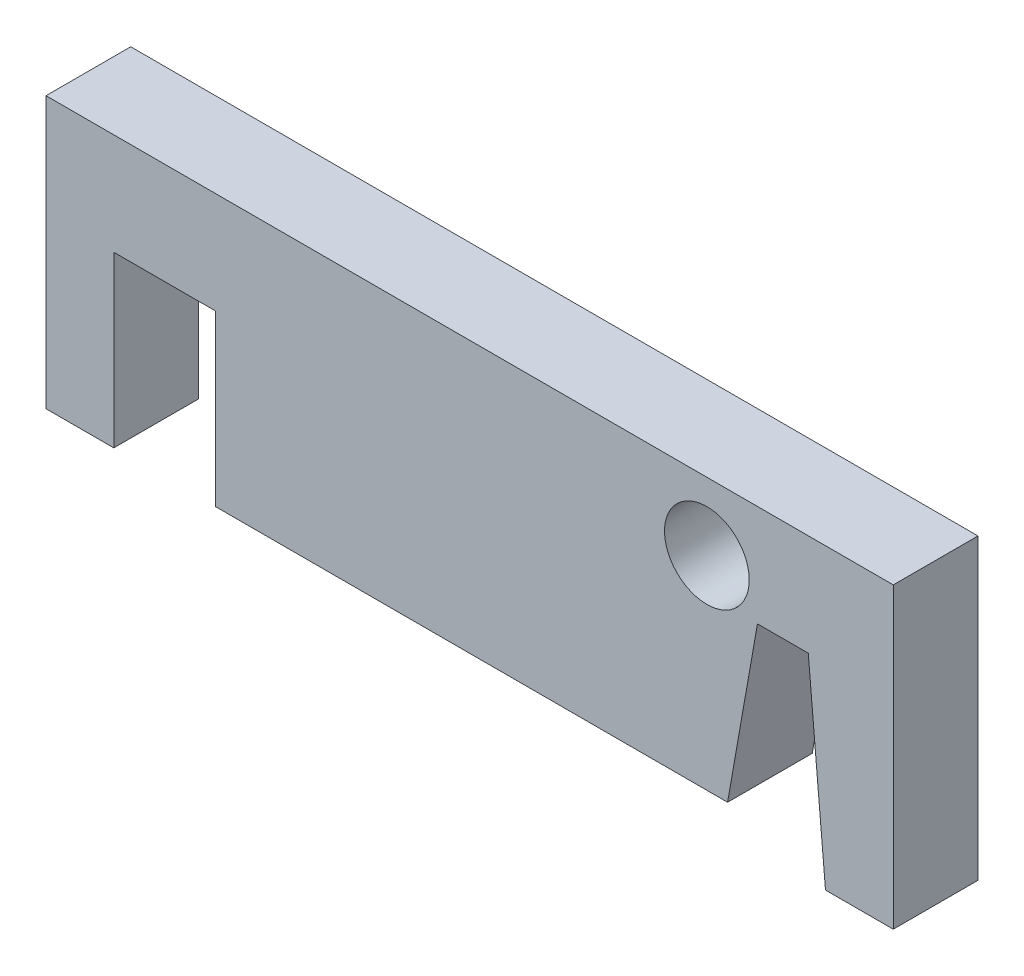
ISO-10303-21;
HEADER;
FILE_DESCRIPTION(('STEP AP214'),'2;1');
FILE_NAME('part.step','',(''),(''),'','','');
FILE_SCHEMA(('AUTOMOTIVE_DESIGN { 1 0 10303 214 1 1 1 1 }'));
ENDSEC;
DATA;
#1=APPLICATION_CONTEXT('core data for automotive mechanical design processes');
#2=APPLICATION_PROTOCOL_DEFINITION('international standard','automotive_design',2000,#1);
#3=PRODUCT_CONTEXT('',#1,'mechanical');
#4=PRODUCT('Part','Part','',(#3));
#5=PRODUCT_RELATED_PRODUCT_CATEGORY('part','',(#4));
#6=PRODUCT_DEFINITION_FORMATION('','',#4);
#7=PRODUCT_DEFINITION_CONTEXT('part definition',#1,'design');
#8=PRODUCT_DEFINITION('design','',#6,#7);
#9=PRODUCT_DEFINITION_SHAPE('','',#8);
#10=(LENGTH_UNIT() NAMED_UNIT(*) SI_UNIT(.MILLI.,.METRE.));
#11=(NAMED_UNIT(*) PLANE_ANGLE_UNIT() SI_UNIT($,.RADIAN.));
#12=(NAMED_UNIT(*) SI_UNIT($,.STERADIAN.) SOLID_ANGLE_UNIT());
#13=UNCERTAINTY_MEASURE_WITH_UNIT(LENGTH_MEASURE(1.E-05),#10,'distance_accuracy_value','');
#14=(GEOMETRIC_REPRESENTATION_CONTEXT(3) GLOBAL_UNCERTAINTY_ASSIGNED_CONTEXT((#13)) GLOBAL_UNIT_ASSIGNED_CONTEXT((#10,
#11,#12)) REPRESENTATION_CONTEXT('',''));
#15=CARTESIAN_POINT('',(0.,0.,0.));
#16=DIRECTION('',(0.,0.,1.));
#17=DIRECTION('',(1.,0.,0.));
#18=AXIS2_PLACEMENT_3D('',#15,#16,#17);
#19=CARTESIAN_POINT('',(0.,-13.97,3.175));
#20=DIRECTION('',(0.,-1.,0.));
#21=DIRECTION('',(1.,0.,0.));
#22=AXIS2_PLACEMENT_3D('',#19,#20,#21);
#23=PLANE('',#22);
#24=DIRECTION('',(0.,0.,1.));
#25=VECTOR('',#24,1.);
#26=CARTESIAN_POINT('',(-19.05,-13.97,-3.175));
#27=LINE('',#26,#25);
#28=CARTESIAN_POINT('',(-19.05,-13.97,-3.175));
#29=VERTEX_POINT('',#28);
#30=CARTESIAN_POINT('',(-19.05,-13.97,3.175));
#31=VERTEX_POINT('',#30);
#32=EDGE_CURVE('E169',#29,#31,#27,.T.);
#33=ORIENTED_EDGE('',*,*,#32,.F.);
#34=DIRECTION('',(-1.,0.,0.));
#35=VECTOR('',#34,1.);
#36=CARTESIAN_POINT('',(0.,-13.97,-3.175));
#37=LINE('',#36,#35);
#38=CARTESIAN_POINT('',(19.3317643539386,-13.97,-3.175));
#39=VERTEX_POINT('',#38);
#40=EDGE_CURVE('E194',#39,#29,#37,.T.);
#41=ORIENTED_EDGE('',*,*,#40,.F.);
#42=DIRECTION('',(0.,0.,-1.));
#43=VECTOR('',#42,1.);
#44=CARTESIAN_POINT('',(19.3317643539386,-13.97,3.175));
#45=LINE('',#44,#43);
#46=CARTESIAN_POINT('',(19.3317643539386,-13.97,3.175));
#47=VERTEX_POINT('',#46);
#48=EDGE_CURVE('E72',#47,#39,#45,.T.);
#49=ORIENTED_EDGE('',*,*,#48,.F.);
#50=DIRECTION('',(-1.,0.,0.));
#51=VECTOR('',#50,1.);
#52=CARTESIAN_POINT('',(0.,-13.97,3.175));
#53=LINE('',#52,#51);
#54=EDGE_CURVE('E159',#47,#31,#53,.T.);
#55=ORIENTED_EDGE('',*,*,#54,.T.);
#56=EDGE_LOOP('',(#33,#41,#49,#55));
#57=FACE_BOUND('',#56,.T.);
#58=ADVANCED_FACE('F47',(#57),#23,.T.);
#59=CARTESIAN_POINT('',(21.1378510331832,-3.72717345134659,3.175));
#60=DIRECTION('',(0.984807753012207,-0.173648177666934,0.));
#61=DIRECTION('',(0.173648177666934,0.984807753012207,0.));
#62=AXIS2_PLACEMENT_3D('',#59,#60,#61);
#63=PLANE('',#62);
#64=DIRECTION('',(-0.173648177666934,-0.984807753012208,0.));
#65=VECTOR('',#64,1.);
#66=CARTESIAN_POINT('',(21.1378510331832,-3.72717345134659,-3.175));
#67=LINE('',#66,#65);
#68=CARTESIAN_POINT('',(21.5711170089362,-1.27,-3.175));
#69=VERTEX_POINT('',#68);
#70=EDGE_CURVE('E168',#69,#39,#67,.T.);
#71=ORIENTED_EDGE('',*,*,#70,.F.);
#72=DIRECTION('',(0.,0.,-1.));
#73=VECTOR('',#72,1.);
#74=CARTESIAN_POINT('',(21.5711170089362,-1.27,3.175));
#75=LINE('',#74,#73);
#76=CARTESIAN_POINT('',(21.5711170089362,-1.27,3.175));
#77=VERTEX_POINT('',#76);
#78=EDGE_CURVE('E11',#77,#69,#75,.T.);
#79=ORIENTED_EDGE('',*,*,#78,.F.);
#80=DIRECTION('',(-0.173648177666934,-0.984807753012208,0.));
#81=VECTOR('',#80,1.);
#82=CARTESIAN_POINT('',(21.1378510331832,-3.72717345134659,3.175));
#83=LINE('',#82,#81);
#84=EDGE_CURVE('E259',#77,#47,#83,.T.);
#85=ORIENTED_EDGE('',*,*,#84,.T.);
#86=ORIENTED_EDGE('',*,*,#48,.T.);
#87=EDGE_LOOP('',(#71,#79,#85,#86));
#88=FACE_BOUND('',#87,.T.);
#89=ADVANCED_FACE('F229',(#88),#63,.T.);
#90=CARTESIAN_POINT('',(0.,-1.27000000000001,3.175));
#91=DIRECTION('',(0.,-1.,0.));
#92=DIRECTION('',(1.,0.,0.));
#93=AXIS2_PLACEMENT_3D('',#90,#91,#92);
#94=PLANE('',#93);
#95=DIRECTION('',(-1.,0.,0.));
#96=VECTOR('',#95,1.);
#97=CARTESIAN_POINT('',(0.,-1.27000000000001,-3.175));
#98=LINE('',#97,#96);
#99=CARTESIAN_POINT('',(25.3811170089362,-1.27,-3.175));
#100=VERTEX_POINT('',#99);
#101=EDGE_CURVE('E172',#100,#69,#98,.T.);
#102=ORIENTED_EDGE('',*,*,#101,.F.);
#103=DIRECTION('',(0.,0.,-1.));
#104=VECTOR('',#103,1.);
#105=CARTESIAN_POINT('',(25.3811170089362,-1.27,3.175));
#106=LINE('',#105,#104);
#107=CARTESIAN_POINT('',(25.3811170089362,-1.27,3.175));
#108=VERTEX_POINT('',#107);
#109=EDGE_CURVE('E56',#108,#100,#106,.T.);
#110=ORIENTED_EDGE('',*,*,#109,.F.);
#111=DIRECTION('',(-1.,0.,0.));
#112=VECTOR('',#111,1.);
#113=CARTESIAN_POINT('',(0.,-1.27000000000001,3.175));
#114=LINE('',#113,#112);
#115=EDGE_CURVE('E228',#108,#77,#114,.T.);
#116=ORIENTED_EDGE('',*,*,#115,.T.);
#117=ORIENTED_EDGE('',*,*,#78,.T.);
#118=EDGE_LOOP('',(#102,#110,#116,#117));
#119=FACE_BOUND('',#118,.T.);
#120=ADVANCED_FACE('F227',(#119),#94,.T.);
#121=CARTESIAN_POINT('',(25.0780523169048,2.19404528103904,3.175));
#122=DIRECTION('',(0.996194698091746,0.0871557427476517,0.));
#123=DIRECTION('',(-0.0871557427476517,0.996194698091746,0.));
#124=AXIS2_PLACEMENT_3D('',#121,#122,#123);
#125=PLANE('',#124);
#126=DIRECTION('',(0.0871557427476517,-0.996194698091746,0.));
#127=VECTOR('',#126,1.);
#128=CARTESIAN_POINT('',(25.0780523169048,2.19404528103904,-3.175));
#129=LINE('',#128,#127);
#130=CARTESIAN_POINT('',(26.67,-16.002,-3.175));
#131=VERTEX_POINT('',#130);
#132=EDGE_CURVE('E176',#100,#131,#129,.T.);
#133=ORIENTED_EDGE('',*,*,#132,.T.);
#134=DIRECTION('',(0.,0.,-1.));
#135=VECTOR('',#134,1.);
#136=CARTESIAN_POINT('',(26.67,-16.002,3.175));
#137=LINE('',#136,#135);
#138=CARTESIAN_POINT('',(26.67,-16.002,3.175));
#139=VERTEX_POINT('',#138);
#140=EDGE_CURVE('E209',#139,#131,#137,.T.);
#141=ORIENTED_EDGE('',*,*,#140,.F.);
#142=DIRECTION('',(0.0871557427476517,-0.996194698091746,0.));
#143=VECTOR('',#142,1.);
#144=CARTESIAN_POINT('',(25.0780523169048,2.19404528103904,3.175));
#145=LINE('',#144,#143);
#146=EDGE_CURVE('E219',#108,#139,#145,.T.);
#147=ORIENTED_EDGE('',*,*,#146,.F.);
#148=ORIENTED_EDGE('',*,*,#109,.T.);
#149=EDGE_LOOP('',(#133,#141,#147,#148));
#150=FACE_BOUND('',#149,.T.);
#151=ADVANCED_FACE('F216',(#150),#125,.F.);
#152=CARTESIAN_POINT('',(0.,-16.002,3.175));
#153=DIRECTION('',(0.,1.,0.));
#154=DIRECTION('',(0.,0.,1.));
#155=AXIS2_PLACEMENT_3D('',#152,#153,#154);
#156=PLANE('',#155);
#157=DIRECTION('',(1.,0.,0.));
#158=VECTOR('',#157,1.);
#159=CARTESIAN_POINT('',(0.,-16.002,-3.175));
#160=LINE('',#159,#158);
#161=CARTESIAN_POINT('',(31.75,-16.002,-3.175));
#162=VERTEX_POINT('',#161);
#163=EDGE_CURVE('E180',#131,#162,#160,.T.);
#164=ORIENTED_EDGE('',*,*,#163,.T.);
#165=DIRECTION('',(0.,0.,-1.));
#166=VECTOR('',#165,1.);
#167=CARTESIAN_POINT('',(31.75,-16.002,3.175));
#168=LINE('',#167,#166);
#169=CARTESIAN_POINT('',(31.75,-16.002,3.175));
#170=VERTEX_POINT('',#169);
#171=EDGE_CURVE('E205',#170,#162,#168,.T.);
#172=ORIENTED_EDGE('',*,*,#171,.F.);
#173=DIRECTION('',(1.,0.,0.));
#174=VECTOR('',#173,1.);
#175=CARTESIAN_POINT('',(0.,-16.002,3.175));
#176=LINE('',#175,#174);
#177=EDGE_CURVE('E266',#139,#170,#176,.T.);
#178=ORIENTED_EDGE('',*,*,#177,.F.);
#179=ORIENTED_EDGE('',*,*,#140,.T.);
#180=EDGE_LOOP('',(#164,#172,#178,#179));
#181=FACE_BOUND('',#180,.T.);
#182=ADVANCED_FACE('F307',(#181),#156,.F.);
#183=CARTESIAN_POINT('',(31.75,0.,3.175));
#184=DIRECTION('',(-1.,0.,0.));
#185=DIRECTION('',(0.,0.,1.));
#186=AXIS2_PLACEMENT_3D('',#183,#184,#185);
#187=PLANE('',#186);
#188=DIRECTION('',(0.,1.,0.));
#189=VECTOR('',#188,1.);
#190=CARTESIAN_POINT('',(31.75,0.,-3.175));
#191=LINE('',#190,#189);
#192=CARTESIAN_POINT('',(31.75,6.35,-3.175));
#193=VERTEX_POINT('',#192);
#194=EDGE_CURVE('E184',#162,#193,#191,.T.);
#195=ORIENTED_EDGE('',*,*,#194,.T.);
#196=DIRECTION('',(0.,0.,-1.));
#197=VECTOR('',#196,1.);
#198=CARTESIAN_POINT('',(31.75,6.35,3.175));
#199=LINE('',#198,#197);
#200=CARTESIAN_POINT('',(31.75,6.35,3.175));
#201=VERTEX_POINT('',#200);
#202=EDGE_CURVE('E137',#201,#193,#199,.T.);
#203=ORIENTED_EDGE('',*,*,#202,.F.);
#204=DIRECTION('',(0.,1.,0.));
#205=VECTOR('',#204,1.);
#206=CARTESIAN_POINT('',(31.75,0.,3.175));
#207=LINE('',#206,#205);
#208=EDGE_CURVE('E148',#170,#201,#207,.T.);
#209=ORIENTED_EDGE('',*,*,#208,.F.);
#210=ORIENTED_EDGE('',*,*,#171,.T.);
#211=EDGE_LOOP('',(#195,#203,#209,#210));
#212=FACE_BOUND('',#211,.T.);
#213=ADVANCED_FACE('F309',(#212),#187,.F.);
#214=CARTESIAN_POINT('',(0.,6.35,3.175));
#215=DIRECTION('',(0.,1.,0.));
#216=DIRECTION('',(0.,0.,1.));
#217=AXIS2_PLACEMENT_3D('',#214,#215,#216);
#218=PLANE('',#217);
#219=DIRECTION('',(1.,0.,0.));
#220=VECTOR('',#219,1.);
#221=CARTESIAN_POINT('',(0.,6.35,-3.175));
#222=LINE('',#221,#220);
#223=CARTESIAN_POINT('',(-31.75,6.35,-3.175));
#224=VERTEX_POINT('',#223);
#225=EDGE_CURVE('E131',#224,#193,#222,.T.);
#226=ORIENTED_EDGE('',*,*,#225,.F.);
#227=DIRECTION('',(0.,0.,-1.));
#228=VECTOR('',#227,1.);
#229=CARTESIAN_POINT('',(-31.75,6.35,3.175));
#230=LINE('',#229,#228);
#231=CARTESIAN_POINT('',(-31.75,6.35,3.175));
#232=VERTEX_POINT('',#231);
#233=EDGE_CURVE('E126',#232,#224,#230,.T.);
#234=ORIENTED_EDGE('',*,*,#233,.F.);
#235=DIRECTION('',(1.,0.,0.));
#236=VECTOR('',#235,1.);
#237=CARTESIAN_POINT('',(0.,6.35,3.175));
#238=LINE('',#237,#236);
#239=EDGE_CURVE('E129',#232,#201,#238,.T.);
#240=ORIENTED_EDGE('',*,*,#239,.T.);
#241=ORIENTED_EDGE('',*,*,#202,.T.);
#242=EDGE_LOOP('',(#226,#234,#240,#241));
#243=FACE_BOUND('',#242,.T.);
#244=ADVANCED_FACE('F128',(#243),#218,.T.);
#245=CARTESIAN_POINT('',(-31.75,0.,3.175));
#246=DIRECTION('',(-1.,0.,0.));
#247=DIRECTION('',(0.,0.,1.));
#248=AXIS2_PLACEMENT_3D('',#245,#246,#247);
#249=PLANE('',#248);
#250=DIRECTION('',(0.,1.,0.));
#251=VECTOR('',#250,1.);
#252=CARTESIAN_POINT('',(-31.75,0.,-3.175));
#253=LINE('',#252,#251);
#254=CARTESIAN_POINT('',(-31.75,-13.97,-3.175));
#255=VERTEX_POINT('',#254);
#256=EDGE_CURVE('E190',#255,#224,#253,.T.);
#257=ORIENTED_EDGE('',*,*,#256,.F.);
#258=DIRECTION('',(0.,0.,-1.));
#259=VECTOR('',#258,1.);
#260=CARTESIAN_POINT('',(-31.75,-13.97,3.175));
#261=LINE('',#260,#259);
#262=CARTESIAN_POINT('',(-31.75,-13.97,3.175));
#263=VERTEX_POINT('',#262);
#264=EDGE_CURVE('E138',#263,#255,#261,.T.);
#265=ORIENTED_EDGE('',*,*,#264,.F.);
#266=DIRECTION('',(0.,1.,0.));
#267=VECTOR('',#266,1.);
#268=CARTESIAN_POINT('',(-31.75,0.,3.175));
#269=LINE('',#268,#267);
#270=EDGE_CURVE('E146',#263,#232,#269,.T.);
#271=ORIENTED_EDGE('',*,*,#270,.T.);
#272=ORIENTED_EDGE('',*,*,#233,.T.);
#273=EDGE_LOOP('',(#257,#265,#271,#272));
#274=FACE_BOUND('',#273,.T.);
#275=ADVANCED_FACE('F153',(#274),#249,.T.);
#276=CARTESIAN_POINT('',(17.78,1.26999999999999,3.175));
#277=DIRECTION('',(0.,0.,-1.));
#278=DIRECTION('',(-1.,0.,0.));
#279=AXIS2_PLACEMENT_3D('',#276,#277,#278);
#280=CYLINDRICAL_SURFACE('',#279,3.17500000000001);
#281=CARTESIAN_POINT('',(17.78,1.26999999999999,3.175));
#282=DIRECTION('',(0.,0.,1.));
#283=DIRECTION('',(1.,0.,0.));
#284=AXIS2_PLACEMENT_3D('',#281,#282,#283);
#285=CIRCLE('',#284,3.17500000000001);
#286=CARTESIAN_POINT('',(20.955,1.26999999999999,3.175));
#287=VERTEX_POINT('',#286);
#288=EDGE_CURVE('E198',#287,#287,#285,.T.);
#289=ORIENTED_EDGE('',*,*,#288,.T.);
#290=EDGE_LOOP('',(#289));
#291=FACE_BOUND('',#290,.T.);
#292=CARTESIAN_POINT('',(17.78,1.26999999999999,-3.175));
#293=DIRECTION('',(0.,0.,1.));
#294=DIRECTION('',(1.,0.,0.));
#295=AXIS2_PLACEMENT_3D('',#292,#293,#294);
#296=CIRCLE('',#295,3.17500000000001);
#297=CARTESIAN_POINT('',(20.955,1.26999999999999,-3.175));
#298=VERTEX_POINT('',#297);
#299=EDGE_CURVE('E164',#298,#298,#296,.T.);
#300=ORIENTED_EDGE('',*,*,#299,.F.);
#301=EDGE_LOOP('',(#300));
#302=FACE_BOUND('',#301,.T.);
#303=ADVANCED_FACE('F49',(#291,#302),#280,.F.);
#304=DIRECTION('',(0.,0.,1.));
#305=VECTOR('',#304,1.);
#306=CARTESIAN_POINT('',(-26.67,-13.97,-3.175));
#307=LINE('',#306,#305);
#308=CARTESIAN_POINT('',(-26.67,-13.97,-3.175));
#309=VERTEX_POINT('',#308);
#310=CARTESIAN_POINT('',(-26.67,-13.97,3.175));
#311=VERTEX_POINT('',#310);
#312=EDGE_CURVE('E240',#309,#311,#307,.T.);
#313=ORIENTED_EDGE('',*,*,#312,.T.);
#314=EDGE_CURVE('E156',#311,#263,#53,.T.);
#315=ORIENTED_EDGE('',*,*,#314,.T.);
#316=ORIENTED_EDGE('',*,*,#264,.T.);
#317=EDGE_CURVE('E193',#309,#255,#37,.T.);
#318=ORIENTED_EDGE('',*,*,#317,.F.);
#319=EDGE_LOOP('',(#313,#315,#316,#318));
#320=FACE_BOUND('',#319,.T.);
#321=ADVANCED_FACE('F273',(#320),#23,.T.);
#322=CARTESIAN_POINT('',(0.,0.,3.175));
#323=DIRECTION('',(0.,0.,1.));
#324=DIRECTION('',(1.,0.,0.));
#325=AXIS2_PLACEMENT_3D('',#322,#323,#324);
#326=PLANE('',#325);
#327=DIRECTION('',(0.,1.,0.));
#328=VECTOR('',#327,1.);
#329=CARTESIAN_POINT('',(-19.05,-13.97,3.175));
#330=LINE('',#329,#328);
#331=CARTESIAN_POINT('',(-19.05,-1.27,3.175));
#332=VERTEX_POINT('',#331);
#333=EDGE_CURVE('E289',#31,#332,#330,.T.);
#334=ORIENTED_EDGE('',*,*,#333,.F.);
#335=ORIENTED_EDGE('',*,*,#54,.F.);
#336=ORIENTED_EDGE('',*,*,#84,.F.);
#337=ORIENTED_EDGE('',*,*,#115,.F.);
#338=ORIENTED_EDGE('',*,*,#146,.T.);
#339=ORIENTED_EDGE('',*,*,#177,.T.);
#340=ORIENTED_EDGE('',*,*,#208,.T.);
#341=ORIENTED_EDGE('',*,*,#239,.F.);
#342=ORIENTED_EDGE('',*,*,#270,.F.);
#343=ORIENTED_EDGE('',*,*,#314,.F.);
#344=DIRECTION('',(0.,-1.,0.));
#345=VECTOR('',#344,1.);
#346=CARTESIAN_POINT('',(-26.67,-13.97,3.175));
#347=LINE('',#346,#345);
#348=CARTESIAN_POINT('',(-26.67,-1.27,3.175));
#349=VERTEX_POINT('',#348);
#350=EDGE_CURVE('E247',#349,#311,#347,.T.);
#351=ORIENTED_EDGE('',*,*,#350,.F.);
#352=DIRECTION('',(-1.,0.,0.));
#353=VECTOR('',#352,1.);
#354=CARTESIAN_POINT('',(-19.05,-1.27,3.175));
#355=LINE('',#354,#353);
#356=EDGE_CURVE('E299',#332,#349,#355,.T.);
#357=ORIENTED_EDGE('',*,*,#356,.F.);
#358=EDGE_LOOP('',(#334,#335,#336,#337,#338,#339,#340,#341,#342,#343,#351,#357));
#359=FACE_BOUND('',#358,.T.);
#360=ORIENTED_EDGE('',*,*,#288,.F.);
#361=EDGE_LOOP('',(#360));
#362=FACE_BOUND('',#361,.T.);
#363=ADVANCED_FACE('F143',(#359,#362),#326,.T.);
#364=CARTESIAN_POINT('',(0.,0.,-3.175));
#365=DIRECTION('',(0.,0.,1.));
#366=DIRECTION('',(1.,0.,0.));
#367=AXIS2_PLACEMENT_3D('',#364,#365,#366);
#368=PLANE('',#367);
#369=ORIENTED_EDGE('',*,*,#40,.T.);
#370=DIRECTION('',(0.,1.,0.));
#371=VECTOR('',#370,1.);
#372=CARTESIAN_POINT('',(-19.05,-13.97,-3.175));
#373=LINE('',#372,#371);
#374=CARTESIAN_POINT('',(-19.05,-1.27,-3.175));
#375=VERTEX_POINT('',#374);
#376=EDGE_CURVE('E288',#29,#375,#373,.T.);
#377=ORIENTED_EDGE('',*,*,#376,.T.);
#378=DIRECTION('',(-1.,0.,0.));
#379=VECTOR('',#378,1.);
#380=CARTESIAN_POINT('',(-19.05,-1.27,-3.175));
#381=LINE('',#380,#379);
#382=CARTESIAN_POINT('',(-26.67,-1.27,-3.175));
#383=VERTEX_POINT('',#382);
#384=EDGE_CURVE('E292',#375,#383,#381,.T.);
#385=ORIENTED_EDGE('',*,*,#384,.T.);
#386=DIRECTION('',(0.,-1.,0.));
#387=VECTOR('',#386,1.);
#388=CARTESIAN_POINT('',(-26.67,-13.97,-3.175));
#389=LINE('',#388,#387);
#390=EDGE_CURVE('E63',#383,#309,#389,.T.);
#391=ORIENTED_EDGE('',*,*,#390,.T.);
#392=ORIENTED_EDGE('',*,*,#317,.T.);
#393=ORIENTED_EDGE('',*,*,#256,.T.);
#394=ORIENTED_EDGE('',*,*,#225,.T.);
#395=ORIENTED_EDGE('',*,*,#194,.F.);
#396=ORIENTED_EDGE('',*,*,#163,.F.);
#397=ORIENTED_EDGE('',*,*,#132,.F.);
#398=ORIENTED_EDGE('',*,*,#101,.T.);
#399=ORIENTED_EDGE('',*,*,#70,.T.);
#400=EDGE_LOOP('',(#369,#377,#385,#391,#392,#393,#394,#395,#396,#397,#398,#399));
#401=FACE_BOUND('',#400,.T.);
#402=ORIENTED_EDGE('',*,*,#299,.T.);
#403=EDGE_LOOP('',(#402));
#404=FACE_BOUND('',#403,.T.);
#405=ADVANCED_FACE('F225',(#401,#404),#368,.F.);
#406=CARTESIAN_POINT('',(-19.05,-13.97,-3.175));
#407=DIRECTION('',(1.,0.,0.));
#408=DIRECTION('',(0.,1.,0.));
#409=AXIS2_PLACEMENT_3D('',#406,#407,#408);
#410=PLANE('',#409);
#411=ORIENTED_EDGE('',*,*,#333,.T.);
#412=DIRECTION('',(0.,0.,1.));
#413=VECTOR('',#412,1.);
#414=CARTESIAN_POINT('',(-19.05,-1.27,-3.175));
#415=LINE('',#414,#413);
#416=EDGE_CURVE('E252',#375,#332,#415,.T.);
#417=ORIENTED_EDGE('',*,*,#416,.F.);
#418=ORIENTED_EDGE('',*,*,#376,.F.);
#419=ORIENTED_EDGE('',*,*,#32,.T.);
#420=EDGE_LOOP('',(#411,#417,#418,#419));
#421=FACE_BOUND('',#420,.T.);
#422=ADVANCED_FACE('F287',(#421),#410,.F.);
#423=CARTESIAN_POINT('',(-26.67,-13.97,-3.175));
#424=DIRECTION('',(-1.,0.,0.));
#425=DIRECTION('',(0.,0.,1.));
#426=AXIS2_PLACEMENT_3D('',#423,#424,#425);
#427=PLANE('',#426);
#428=ORIENTED_EDGE('',*,*,#350,.T.);
#429=ORIENTED_EDGE('',*,*,#312,.F.);
#430=ORIENTED_EDGE('',*,*,#390,.F.);
#431=DIRECTION('',(0.,0.,1.));
#432=VECTOR('',#431,1.);
#433=CARTESIAN_POINT('',(-26.67,-1.27,-3.175));
#434=LINE('',#433,#432);
#435=EDGE_CURVE('E244',#383,#349,#434,.T.);
#436=ORIENTED_EDGE('',*,*,#435,.T.);
#437=EDGE_LOOP('',(#428,#429,#430,#436));
#438=FACE_BOUND('',#437,.T.);
#439=ADVANCED_FACE('F342',(#438),#427,.F.);
#440=CARTESIAN_POINT('',(-19.05,-1.27,-3.175));
#441=DIRECTION('',(0.,1.,0.));
#442=DIRECTION('',(-1.,0.,0.));
#443=AXIS2_PLACEMENT_3D('',#440,#441,#442);
#444=PLANE('',#443);
#445=ORIENTED_EDGE('',*,*,#356,.T.);
#446=ORIENTED_EDGE('',*,*,#435,.F.);
#447=ORIENTED_EDGE('',*,*,#384,.F.);
#448=ORIENTED_EDGE('',*,*,#416,.T.);
#449=EDGE_LOOP('',(#445,#446,#447,#448));
#450=FACE_BOUND('',#449,.T.);
#451=ADVANCED_FACE('F293',(#450),#444,.F.);
#452=CLOSED_SHELL('',(#58,#89,#120,#151,#182,#213,#244,#275,#303,#321,#363,#405,#422,#439,#451));
#453=MANIFOLD_SOLID_BREP('B2',#452);
#454=ADVANCED_BREP_SHAPE_REPRESENTATION('',(#18,#453),#14);
#455=SHAPE_DEFINITION_REPRESENTATION(#9,#454);
ENDSEC;
END-ISO-10303-21;
